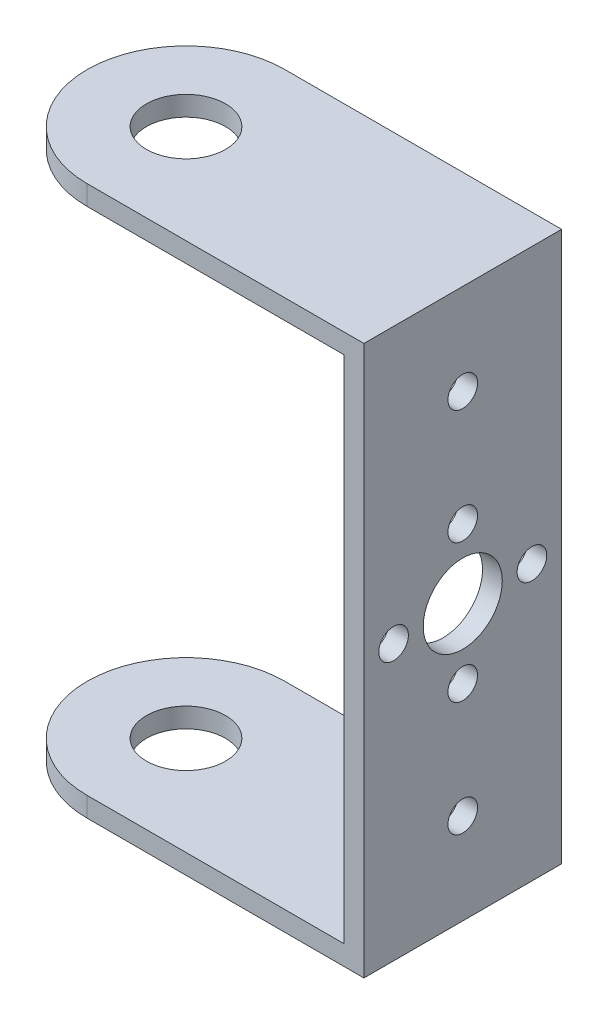
ISO-10303-21;
HEADER;
FILE_DESCRIPTION(('STEP AP214'),'2;1');
FILE_NAME('part.step','',(''),(''),'','','');
FILE_SCHEMA(('AUTOMOTIVE_DESIGN { 1 0 10303 214 1 1 1 1 }'));
ENDSEC;
DATA;
#1=APPLICATION_CONTEXT('core data for automotive mechanical design processes');
#2=APPLICATION_PROTOCOL_DEFINITION('international standard','automotive_design',2000,#1);
#3=PRODUCT_CONTEXT('',#1,'mechanical');
#4=PRODUCT('Part','Part','',(#3));
#5=PRODUCT_RELATED_PRODUCT_CATEGORY('part','',(#4));
#6=PRODUCT_DEFINITION_FORMATION('','',#4);
#7=PRODUCT_DEFINITION_CONTEXT('part definition',#1,'design');
#8=PRODUCT_DEFINITION('design','',#6,#7);
#9=PRODUCT_DEFINITION_SHAPE('','',#8);
#10=(LENGTH_UNIT() NAMED_UNIT(*) SI_UNIT(.MILLI.,.METRE.));
#11=(NAMED_UNIT(*) PLANE_ANGLE_UNIT() SI_UNIT($,.RADIAN.));
#12=(NAMED_UNIT(*) SI_UNIT($,.STERADIAN.) SOLID_ANGLE_UNIT());
#13=UNCERTAINTY_MEASURE_WITH_UNIT(LENGTH_MEASURE(1.E-05),#10,'distance_accuracy_value','');
#14=(GEOMETRIC_REPRESENTATION_CONTEXT(3) GLOBAL_UNCERTAINTY_ASSIGNED_CONTEXT((#13)) GLOBAL_UNIT_ASSIGNED_CONTEXT((#10,
#11,#12)) REPRESENTATION_CONTEXT('',''));
#15=CARTESIAN_POINT('',(0.,0.,0.));
#16=DIRECTION('',(0.,0.,1.));
#17=DIRECTION('',(1.,0.,0.));
#18=AXIS2_PLACEMENT_3D('',#15,#16,#17);
#19=CARTESIAN_POINT('',(14.0000000000001,-27.8000000000001,20.0000000000002));
#20=DIRECTION('',(-0.999999999999999,0.,0.));
#21=DIRECTION('',(0.,0.,0.999999999999999));
#22=AXIS2_PLACEMENT_3D('',#19,#20,#21);
#23=PLANE('',#22);
#24=CARTESIAN_POINT('',(14.,18.6000000000001,9.99999999999979));
#25=DIRECTION('',(0.999999999999999,0.,0.));
#26=DIRECTION('',(0.,0.,-0.999999999999999));
#27=AXIS2_PLACEMENT_3D('',#24,#25,#26);
#28=CIRCLE('',#27,1.5);
#29=CARTESIAN_POINT('',(14.,18.6000000000001,8.49999999999979));
#30=VERTEX_POINT('',#29);
#31=EDGE_CURVE('E209',#30,#30,#28,.T.);
#32=ORIENTED_EDGE('',*,*,#31,.F.);
#33=EDGE_LOOP('',(#32));
#34=FACE_BOUND('',#33,.T.);
#35=CARTESIAN_POINT('',(14.,-18.6000000000001,9.99999999999984));
#36=DIRECTION('',(0.999999999999999,0.,0.));
#37=DIRECTION('',(0.,0.,-0.999999999999999));
#38=AXIS2_PLACEMENT_3D('',#35,#36,#37);
#39=CIRCLE('',#38,1.5);
#40=CARTESIAN_POINT('',(14.,-18.6000000000001,8.49999999999984));
#41=VERTEX_POINT('',#40);
#42=EDGE_CURVE('E213',#41,#41,#39,.T.);
#43=ORIENTED_EDGE('',*,*,#42,.F.);
#44=EDGE_LOOP('',(#43));
#45=FACE_BOUND('',#44,.T.);
#46=CARTESIAN_POINT('',(14.,7.00000000000003,10.0000000000002));
#47=DIRECTION('',(0.999999999999999,0.,0.));
#48=DIRECTION('',(0.,0.,-0.999999999999999));
#49=AXIS2_PLACEMENT_3D('',#46,#47,#48);
#50=CIRCLE('',#49,1.5);
#51=CARTESIAN_POINT('',(14.,7.00000000000003,8.50000000000023));
#52=VERTEX_POINT('',#51);
#53=EDGE_CURVE('E217',#52,#52,#50,.T.);
#54=ORIENTED_EDGE('',*,*,#53,.F.);
#55=EDGE_LOOP('',(#54));
#56=FACE_BOUND('',#55,.T.);
#57=CARTESIAN_POINT('',(14.0000000000001,3.2612801348364E-12,3.00000000000267));
#58=DIRECTION('',(0.999999999999999,0.,0.));
#59=DIRECTION('',(0.,0.,-0.999999999999999));
#60=AXIS2_PLACEMENT_3D('',#57,#58,#59);
#61=CIRCLE('',#60,1.5);
#62=CARTESIAN_POINT('',(14.0000000000001,3.26161320174378E-12,1.50000000000267));
#63=VERTEX_POINT('',#62);
#64=EDGE_CURVE('E221',#63,#63,#61,.T.);
#65=ORIENTED_EDGE('',*,*,#64,.F.);
#66=EDGE_LOOP('',(#65));
#67=FACE_BOUND('',#66,.T.);
#68=CARTESIAN_POINT('',(14.0000000000001,-6.99999999999384,9.99999999999968));
#69=DIRECTION('',(0.999999999999999,0.,0.));
#70=DIRECTION('',(0.,0.,-0.999999999999999));
#71=AXIS2_PLACEMENT_3D('',#68,#69,#70);
#72=CIRCLE('',#71,1.5);
#73=CARTESIAN_POINT('',(14.0000000000001,-6.99999999999384,8.49999999999968));
#74=VERTEX_POINT('',#73);
#75=EDGE_CURVE('E225',#74,#74,#72,.T.);
#76=ORIENTED_EDGE('',*,*,#75,.F.);
#77=EDGE_LOOP('',(#76));
#78=FACE_BOUND('',#77,.T.);
#79=CARTESIAN_POINT('',(14.,2.94209101525666E-12,16.9999999999965));
#80=DIRECTION('',(0.999999999999999,0.,0.));
#81=DIRECTION('',(0.,0.,-0.999999999999999));
#82=AXIS2_PLACEMENT_3D('',#79,#80,#81);
#83=CIRCLE('',#82,1.5);
#84=CARTESIAN_POINT('',(14.,2.94242408216405E-12,15.4999999999965));
#85=VERTEX_POINT('',#84);
#86=EDGE_CURVE('E229',#85,#85,#83,.T.);
#87=ORIENTED_EDGE('',*,*,#86,.F.);
#88=EDGE_LOOP('',(#87));
#89=FACE_BOUND('',#88,.T.);
#90=CARTESIAN_POINT('',(13.9999999999998,0.,9.99999999999968));
#91=DIRECTION('',(0.999999999999999,0.,0.));
#92=DIRECTION('',(0.,0.,-0.999999999999999));
#93=AXIS2_PLACEMENT_3D('',#90,#91,#92);
#94=CIRCLE('',#93,4.);
#95=CARTESIAN_POINT('',(13.9999999999998,0.,5.99999999999968));
#96=VERTEX_POINT('',#95);
#97=EDGE_CURVE('E232',#96,#96,#94,.T.);
#98=ORIENTED_EDGE('',*,*,#97,.F.);
#99=EDGE_LOOP('',(#98));
#100=FACE_BOUND('',#99,.T.);
#101=DIRECTION('',(0.,1.00000000000001,0.));
#102=VECTOR('',#101,1.);
#103=CARTESIAN_POINT('',(13.9999999999999,-27.8,1.11022302462516E-13));
#104=LINE('',#103,#102);
#105=CARTESIAN_POINT('',(13.9999999999999,-27.8,1.11022302462516E-13));
#106=VERTEX_POINT('',#105);
#107=CARTESIAN_POINT('',(14.0000000000001,27.8000000000002,-3.88578058618805E-13));
#108=VERTEX_POINT('',#107);
#109=EDGE_CURVE('E138',#106,#108,#104,.T.);
#110=ORIENTED_EDGE('',*,*,#109,.T.);
#111=DIRECTION('',(0.,0.,-0.999999999999999));
#112=VECTOR('',#111,1.);
#113=CARTESIAN_POINT('',(14.,27.8000000000002,19.9999999999996));
#114=LINE('',#113,#112);
#115=CARTESIAN_POINT('',(14.,27.8000000000002,19.9999999999996));
#116=VERTEX_POINT('',#115);
#117=EDGE_CURVE('E11',#116,#108,#114,.T.);
#118=ORIENTED_EDGE('',*,*,#117,.F.);
#119=DIRECTION('',(0.,1.00000000000001,0.));
#120=VECTOR('',#119,1.);
#121=CARTESIAN_POINT('',(14.0000000000001,-27.8000000000001,20.0000000000002));
#122=LINE('',#121,#120);
#123=CARTESIAN_POINT('',(14.0000000000001,-27.8000000000001,20.0000000000002));
#124=VERTEX_POINT('',#123);
#125=EDGE_CURVE('E140',#124,#116,#122,.T.);
#126=ORIENTED_EDGE('',*,*,#125,.F.);
#127=DIRECTION('',(0.,0.,-0.999999999999999));
#128=VECTOR('',#127,1.);
#129=CARTESIAN_POINT('',(14.0000000000001,-27.8000000000001,20.0000000000002));
#130=LINE('',#129,#128);
#131=EDGE_CURVE('E149',#124,#106,#130,.T.);
#132=ORIENTED_EDGE('',*,*,#131,.T.);
#133=EDGE_LOOP('',(#110,#118,#126,#132));
#134=FACE_BOUND('',#133,.T.);
#135=ADVANCED_FACE('F40',(#34,#45,#56,#67,#78,#89,#100,#134),#23,.F.);
#136=CARTESIAN_POINT('',(-13.9999999999998,27.8000000000002,19.9999999999999));
#137=DIRECTION('',(0.,-1.00000000000001,0.));
#138=DIRECTION('',(0.,0.,-0.999999999999999));
#139=AXIS2_PLACEMENT_3D('',#136,#137,#138);
#140=PLANE('',#139);
#141=CARTESIAN_POINT('',(-14.,27.8000000000002,9.99999999999984));
#142=DIRECTION('',(0.,1.00000000000001,0.));
#143=DIRECTION('',(0.,0.,0.999999999999999));
#144=AXIS2_PLACEMENT_3D('',#141,#142,#143);
#145=CIRCLE('',#144,4.);
#146=CARTESIAN_POINT('',(-14.,27.8000000000002,13.9999999999998));
#147=VERTEX_POINT('',#146);
#148=EDGE_CURVE('E131',#147,#147,#145,.T.);
#149=ORIENTED_EDGE('',*,*,#148,.F.);
#150=EDGE_LOOP('',(#149));
#151=FACE_BOUND('',#150,.T.);
#152=DIRECTION('',(-1.,0.,0.));
#153=VECTOR('',#152,1.);
#154=CARTESIAN_POINT('',(-14.,27.8,0.));
#155=LINE('',#154,#153);
#156=CARTESIAN_POINT('',(-14.,27.8,0.));
#157=VERTEX_POINT('',#156);
#158=EDGE_CURVE('E152',#108,#157,#155,.T.);
#159=ORIENTED_EDGE('',*,*,#158,.T.);
#160=CARTESIAN_POINT('',(-14.,27.8000000000002,9.99999999999984));
#161=DIRECTION('',(0.,1.00000000000001,0.));
#162=DIRECTION('',(0.,0.,0.999999999999999));
#163=AXIS2_PLACEMENT_3D('',#160,#161,#162);
#164=CIRCLE('',#163,10.);
#165=CARTESIAN_POINT('',(-13.9999999999998,27.8000000000002,19.9999999999999));
#166=VERTEX_POINT('',#165);
#167=EDGE_CURVE('E128',#157,#166,#164,.T.);
#168=ORIENTED_EDGE('',*,*,#167,.T.);
#169=DIRECTION('',(-1.,0.,0.));
#170=VECTOR('',#169,1.);
#171=CARTESIAN_POINT('',(-13.9999999999998,27.8000000000002,19.9999999999999));
#172=LINE('',#171,#170);
#173=EDGE_CURVE('E94',#116,#166,#172,.T.);
#174=ORIENTED_EDGE('',*,*,#173,.F.);
#175=ORIENTED_EDGE('',*,*,#117,.T.);
#176=EDGE_LOOP('',(#159,#168,#174,#175));
#177=FACE_BOUND('',#176,.T.);
#178=ADVANCED_FACE('F190',(#151,#177),#140,.F.);
#179=CARTESIAN_POINT('',(-12.0000000000001,25.8,20.0000000000002));
#180=DIRECTION('',(0.,1.00000000000001,0.));
#181=DIRECTION('',(0.,0.,0.999999999999999));
#182=AXIS2_PLACEMENT_3D('',#179,#180,#181);
#183=PLANE('',#182);
#184=CARTESIAN_POINT('',(-13.9999999999998,25.8000000000002,9.99999999999995));
#185=DIRECTION('',(0.,1.00000000000001,0.));
#186=DIRECTION('',(0.,0.,0.999999999999999));
#187=AXIS2_PLACEMENT_3D('',#184,#185,#186);
#188=CIRCLE('',#187,4.);
#189=CARTESIAN_POINT('',(-13.9999999999999,25.8000000000002,14.));
#190=VERTEX_POINT('',#189);
#191=EDGE_CURVE('E126',#190,#190,#188,.T.);
#192=ORIENTED_EDGE('',*,*,#191,.T.);
#193=EDGE_LOOP('',(#192));
#194=FACE_BOUND('',#193,.T.);
#195=DIRECTION('',(0.999999999999999,0.,0.));
#196=VECTOR('',#195,1.);
#197=CARTESIAN_POINT('',(-11.9999999999998,25.8000000000001,1.11022302462516E-13));
#198=LINE('',#197,#196);
#199=CARTESIAN_POINT('',(-14.,25.8000000000001,2.77555756156289E-13));
#200=VERTEX_POINT('',#199);
#201=CARTESIAN_POINT('',(12.,25.8,0.));
#202=VERTEX_POINT('',#201);
#203=EDGE_CURVE('E157',#200,#202,#198,.T.);
#204=ORIENTED_EDGE('',*,*,#203,.T.);
#205=DIRECTION('',(0.,0.,-0.999999999999999));
#206=VECTOR('',#205,1.);
#207=CARTESIAN_POINT('',(12.,25.8000000000001,19.9999999999998));
#208=LINE('',#207,#206);
#209=CARTESIAN_POINT('',(12.,25.8000000000001,19.9999999999998));
#210=VERTEX_POINT('',#209);
#211=EDGE_CURVE('E48',#210,#202,#208,.T.);
#212=ORIENTED_EDGE('',*,*,#211,.F.);
#213=DIRECTION('',(0.999999999999999,0.,0.));
#214=VECTOR('',#213,1.);
#215=CARTESIAN_POINT('',(-12.0000000000001,25.8,20.0000000000002));
#216=LINE('',#215,#214);
#217=CARTESIAN_POINT('',(-13.9999999999999,25.8,20.0000000000002));
#218=VERTEX_POINT('',#217);
#219=EDGE_CURVE('E145',#218,#210,#216,.T.);
#220=ORIENTED_EDGE('',*,*,#219,.F.);
#221=CARTESIAN_POINT('',(-13.9999999999998,25.8000000000002,9.99999999999995));
#222=DIRECTION('',(0.,1.00000000000001,0.));
#223=DIRECTION('',(0.,0.,0.999999999999999));
#224=AXIS2_PLACEMENT_3D('',#221,#222,#223);
#225=CIRCLE('',#224,10.);
#226=EDGE_CURVE('E135',#200,#218,#225,.T.);
#227=ORIENTED_EDGE('',*,*,#226,.F.);
#228=EDGE_LOOP('',(#204,#212,#220,#227));
#229=FACE_BOUND('',#228,.T.);
#230=ADVANCED_FACE('F191',(#194,#229),#183,.F.);
#231=CARTESIAN_POINT('',(12.,-25.8000000000002,19.9999999999999));
#232=DIRECTION('',(0.999999999999999,0.,0.));
#233=DIRECTION('',(0.,1.00000000000001,0.));
#234=AXIS2_PLACEMENT_3D('',#231,#232,#233);
#235=PLANE('',#234);
#236=CARTESIAN_POINT('',(12.,18.6000000000001,9.99999999999973));
#237=DIRECTION('',(0.999999999999999,0.,0.));
#238=DIRECTION('',(0.,0.,-0.999999999999999));
#239=AXIS2_PLACEMENT_3D('',#236,#237,#238);
#240=CIRCLE('',#239,1.5);
#241=CARTESIAN_POINT('',(12.,18.6000000000001,8.49999999999973));
#242=VERTEX_POINT('',#241);
#243=EDGE_CURVE('E389',#242,#242,#240,.T.);
#244=ORIENTED_EDGE('',*,*,#243,.T.);
#245=EDGE_LOOP('',(#244));
#246=FACE_BOUND('',#245,.T.);
#247=CARTESIAN_POINT('',(12.0000000000002,-18.6000000000001,9.99999999999995));
#248=DIRECTION('',(0.999999999999999,0.,0.));
#249=DIRECTION('',(0.,0.,-0.999999999999999));
#250=AXIS2_PLACEMENT_3D('',#247,#248,#249);
#251=CIRCLE('',#250,1.5);
#252=CARTESIAN_POINT('',(12.0000000000002,-18.6000000000001,8.49999999999995));
#253=VERTEX_POINT('',#252);
#254=EDGE_CURVE('E390',#253,#253,#251,.T.);
#255=ORIENTED_EDGE('',*,*,#254,.T.);
#256=EDGE_LOOP('',(#255));
#257=FACE_BOUND('',#256,.T.);
#258=CARTESIAN_POINT('',(12.,7.00000000000005,10.0000000000001));
#259=DIRECTION('',(0.999999999999999,0.,0.));
#260=DIRECTION('',(0.,0.,-0.999999999999999));
#261=AXIS2_PLACEMENT_3D('',#258,#259,#260);
#262=CIRCLE('',#261,1.5);
#263=CARTESIAN_POINT('',(12.,7.00000000000005,8.50000000000006));
#264=VERTEX_POINT('',#263);
#265=EDGE_CURVE('E235',#264,#264,#262,.T.);
#266=ORIENTED_EDGE('',*,*,#265,.T.);
#267=EDGE_LOOP('',(#266));
#268=FACE_BOUND('',#267,.T.);
#269=CARTESIAN_POINT('',(12.0000000000001,3.28903571045203E-12,3.00000000000245));
#270=DIRECTION('',(0.999999999999999,0.,0.));
#271=DIRECTION('',(0.,0.,-0.999999999999999));
#272=AXIS2_PLACEMENT_3D('',#269,#270,#271);
#273=CIRCLE('',#272,1.5);
#274=CARTESIAN_POINT('',(12.0000000000001,3.28936877735941E-12,1.50000000000245));
#275=VERTEX_POINT('',#274);
#276=EDGE_CURVE('E398',#275,#275,#273,.T.);
#277=ORIENTED_EDGE('',*,*,#276,.T.);
#278=EDGE_LOOP('',(#277));
#279=FACE_BOUND('',#278,.T.);
#280=CARTESIAN_POINT('',(12.0000000000001,-6.99999999999396,9.99999999999956));
#281=DIRECTION('',(0.999999999999999,0.,0.));
#282=DIRECTION('',(0.,0.,-0.999999999999999));
#283=AXIS2_PLACEMENT_3D('',#280,#281,#282);
#284=CIRCLE('',#283,1.5);
#285=CARTESIAN_POINT('',(12.0000000000001,-6.99999999999396,8.49999999999956));
#286=VERTEX_POINT('',#285);
#287=EDGE_CURVE('E402',#286,#286,#284,.T.);
#288=ORIENTED_EDGE('',*,*,#287,.T.);
#289=EDGE_LOOP('',(#288));
#290=FACE_BOUND('',#289,.T.);
#291=CARTESIAN_POINT('',(12.0000000000001,2.91433543964104E-12,16.9999999999964));
#292=DIRECTION('',(0.999999999999999,0.,0.));
#293=DIRECTION('',(0.,0.,-0.999999999999999));
#294=AXIS2_PLACEMENT_3D('',#291,#292,#293);
#295=CIRCLE('',#294,1.5);
#296=CARTESIAN_POINT('',(12.0000000000001,2.91466850654842E-12,15.4999999999963));
#297=VERTEX_POINT('',#296);
#298=EDGE_CURVE('E406',#297,#297,#295,.T.);
#299=ORIENTED_EDGE('',*,*,#298,.T.);
#300=EDGE_LOOP('',(#299));
#301=FACE_BOUND('',#300,.T.);
#302=CARTESIAN_POINT('',(11.9999999999999,0.,9.99999999999962));
#303=DIRECTION('',(0.999999999999999,0.,0.));
#304=DIRECTION('',(0.,0.,-0.999999999999999));
#305=AXIS2_PLACEMENT_3D('',#302,#303,#304);
#306=CIRCLE('',#305,4.);
#307=CARTESIAN_POINT('',(11.9999999999999,0.,5.99999999999962));
#308=VERTEX_POINT('',#307);
#309=EDGE_CURVE('E234',#308,#308,#306,.T.);
#310=ORIENTED_EDGE('',*,*,#309,.T.);
#311=EDGE_LOOP('',(#310));
#312=FACE_BOUND('',#311,.T.);
#313=DIRECTION('',(0.,-1.00000000000001,0.));
#314=VECTOR('',#313,1.);
#315=CARTESIAN_POINT('',(12.0000000000002,-25.8,0.));
#316=LINE('',#315,#314);
#317=CARTESIAN_POINT('',(12.0000000000002,-25.8,0.));
#318=VERTEX_POINT('',#317);
#319=EDGE_CURVE('E159',#202,#318,#316,.T.);
#320=ORIENTED_EDGE('',*,*,#319,.T.);
#321=DIRECTION('',(0.,0.,-0.999999999999999));
#322=VECTOR('',#321,1.);
#323=CARTESIAN_POINT('',(12.,-25.8000000000002,19.9999999999999));
#324=LINE('',#323,#322);
#325=CARTESIAN_POINT('',(12.,-25.8000000000002,19.9999999999999));
#326=VERTEX_POINT('',#325);
#327=EDGE_CURVE('E167',#326,#318,#324,.T.);
#328=ORIENTED_EDGE('',*,*,#327,.F.);
#329=DIRECTION('',(0.,-1.00000000000001,0.));
#330=VECTOR('',#329,1.);
#331=CARTESIAN_POINT('',(12.,-25.8000000000002,19.9999999999999));
#332=LINE('',#331,#330);
#333=EDGE_CURVE('E114',#210,#326,#332,.T.);
#334=ORIENTED_EDGE('',*,*,#333,.F.);
#335=ORIENTED_EDGE('',*,*,#211,.T.);
#336=EDGE_LOOP('',(#320,#328,#334,#335));
#337=FACE_BOUND('',#336,.T.);
#338=ADVANCED_FACE('F172',(#246,#257,#268,#279,#290,#301,#312,#337),#235,.F.);
#339=CARTESIAN_POINT('',(-14.,-25.8000000000002,20.0000000000001));
#340=DIRECTION('',(0.,-1.00000000000001,0.));
#341=DIRECTION('',(0.,0.,-0.999999999999999));
#342=AXIS2_PLACEMENT_3D('',#339,#340,#341);
#343=PLANE('',#342);
#344=CARTESIAN_POINT('',(-13.9999999999999,-25.8000000000003,10.0000000000001));
#345=DIRECTION('',(0.,1.00000000000001,0.));
#346=DIRECTION('',(0.,0.,0.999999999999999));
#347=AXIS2_PLACEMENT_3D('',#344,#345,#346);
#348=CIRCLE('',#347,4.);
#349=CARTESIAN_POINT('',(-13.9999999999999,-25.8000000000003,14.0000000000001));
#350=VERTEX_POINT('',#349);
#351=EDGE_CURVE('E238',#350,#350,#348,.T.);
#352=ORIENTED_EDGE('',*,*,#351,.F.);
#353=EDGE_LOOP('',(#352));
#354=FACE_BOUND('',#353,.T.);
#355=DIRECTION('',(-0.999999999999999,0.,0.));
#356=VECTOR('',#355,1.);
#357=CARTESIAN_POINT('',(-13.9999999999999,-25.8000000000002,1.11022302462516E-13));
#358=LINE('',#357,#356);
#359=CARTESIAN_POINT('',(-13.9999999999999,-25.8000000000002,1.11022302462516E-13));
#360=VERTEX_POINT('',#359);
#361=EDGE_CURVE('E79',#318,#360,#358,.T.);
#362=ORIENTED_EDGE('',*,*,#361,.T.);
#363=CARTESIAN_POINT('',(-13.9999999999999,-25.8000000000003,10.0000000000001));
#364=DIRECTION('',(0.,1.00000000000001,0.));
#365=DIRECTION('',(0.,0.,0.999999999999999));
#366=AXIS2_PLACEMENT_3D('',#363,#364,#365);
#367=CIRCLE('',#366,10.);
#368=CARTESIAN_POINT('',(-14.,-25.8000000000002,20.0000000000001));
#369=VERTEX_POINT('',#368);
#370=EDGE_CURVE('E122',#360,#369,#367,.T.);
#371=ORIENTED_EDGE('',*,*,#370,.T.);
#372=DIRECTION('',(-0.999999999999999,0.,0.));
#373=VECTOR('',#372,1.);
#374=CARTESIAN_POINT('',(-12.,-25.8000000000002,20.));
#375=LINE('',#374,#373);
#376=EDGE_CURVE('E109',#326,#369,#375,.T.);
#377=ORIENTED_EDGE('',*,*,#376,.F.);
#378=ORIENTED_EDGE('',*,*,#327,.T.);
#379=EDGE_LOOP('',(#362,#371,#377,#378));
#380=FACE_BOUND('',#379,.T.);
#381=ADVANCED_FACE('F125',(#354,#380),#343,.F.);
#382=CARTESIAN_POINT('',(-14.0000000000001,-27.8000000000001,20.0000000000004));
#383=DIRECTION('',(0.,1.00000000000001,0.));
#384=DIRECTION('',(0.,0.,0.999999999999999));
#385=AXIS2_PLACEMENT_3D('',#382,#383,#384);
#386=PLANE('',#385);
#387=CARTESIAN_POINT('',(-13.9999999999998,-27.8000000000001,10.0000000000002));
#388=DIRECTION('',(0.,1.00000000000001,0.));
#389=DIRECTION('',(0.,0.,0.999999999999999));
#390=AXIS2_PLACEMENT_3D('',#387,#388,#389);
#391=CIRCLE('',#390,4.);
#392=CARTESIAN_POINT('',(-13.9999999999999,-27.8000000000001,14.0000000000002));
#393=VERTEX_POINT('',#392);
#394=EDGE_CURVE('E244',#393,#393,#391,.T.);
#395=ORIENTED_EDGE('',*,*,#394,.T.);
#396=EDGE_LOOP('',(#395));
#397=FACE_BOUND('',#396,.T.);
#398=DIRECTION('',(1.,0.,0.));
#399=VECTOR('',#398,1.);
#400=CARTESIAN_POINT('',(-14.0000000000001,-27.8000000000002,1.66533453693773E-13));
#401=LINE('',#400,#399);
#402=CARTESIAN_POINT('',(-14.0000000000001,-27.8000000000002,1.66533453693773E-13));
#403=VERTEX_POINT('',#402);
#404=EDGE_CURVE('E86',#403,#106,#401,.T.);
#405=ORIENTED_EDGE('',*,*,#404,.T.);
#406=ORIENTED_EDGE('',*,*,#131,.F.);
#407=DIRECTION('',(1.,0.,0.));
#408=VECTOR('',#407,1.);
#409=CARTESIAN_POINT('',(-14.0000000000001,-27.8000000000001,20.0000000000004));
#410=LINE('',#409,#408);
#411=CARTESIAN_POINT('',(-14.0000000000001,-27.8000000000001,20.0000000000004));
#412=VERTEX_POINT('',#411);
#413=EDGE_CURVE('E56',#412,#124,#410,.T.);
#414=ORIENTED_EDGE('',*,*,#413,.F.);
#415=CARTESIAN_POINT('',(-13.9999999999998,-27.8000000000001,10.0000000000002));
#416=DIRECTION('',(0.,1.00000000000001,0.));
#417=DIRECTION('',(0.,0.,0.999999999999999));
#418=AXIS2_PLACEMENT_3D('',#415,#416,#417);
#419=CIRCLE('',#418,10.);
#420=EDGE_CURVE('E123',#403,#412,#419,.T.);
#421=ORIENTED_EDGE('',*,*,#420,.F.);
#422=EDGE_LOOP('',(#405,#406,#414,#421));
#423=FACE_BOUND('',#422,.T.);
#424=ADVANCED_FACE('F181',(#397,#423),#386,.F.);
#425=CARTESIAN_POINT('',(0.,0.,20.));
#426=DIRECTION('',(0.,0.,-0.999999999999999));
#427=DIRECTION('',(-0.999999999999999,0.,0.));
#428=AXIS2_PLACEMENT_3D('',#425,#426,#427);
#429=PLANE('',#428);
#430=ORIENTED_EDGE('',*,*,#125,.T.);
#431=ORIENTED_EDGE('',*,*,#173,.T.);
#432=DIRECTION('',(0.,-1.00000000000001,0.));
#433=VECTOR('',#432,1.);
#434=CARTESIAN_POINT('',(-13.9999999999999,25.8,20.0000000000002));
#435=LINE('',#434,#433);
#436=EDGE_CURVE('E143',#166,#218,#435,.T.);
#437=ORIENTED_EDGE('',*,*,#436,.T.);
#438=ORIENTED_EDGE('',*,*,#219,.T.);
#439=ORIENTED_EDGE('',*,*,#333,.T.);
#440=ORIENTED_EDGE('',*,*,#376,.T.);
#441=DIRECTION('',(0.,-1.00000000000001,0.));
#442=VECTOR('',#441,1.);
#443=CARTESIAN_POINT('',(-14.0000000000001,-27.8000000000001,20.0000000000004));
#444=LINE('',#443,#442);
#445=EDGE_CURVE('E112',#369,#412,#444,.T.);
#446=ORIENTED_EDGE('',*,*,#445,.T.);
#447=ORIENTED_EDGE('',*,*,#413,.T.);
#448=EDGE_LOOP('',(#430,#431,#437,#438,#439,#440,#446,#447));
#449=FACE_BOUND('',#448,.T.);
#450=ADVANCED_FACE('F111',(#449),#429,.F.);
#451=CARTESIAN_POINT('',(0.,0.,0.));
#452=DIRECTION('',(0.,0.,-0.999999999999999));
#453=DIRECTION('',(-0.999999999999999,0.,0.));
#454=AXIS2_PLACEMENT_3D('',#451,#452,#453);
#455=PLANE('',#454);
#456=ORIENTED_EDGE('',*,*,#109,.F.);
#457=ORIENTED_EDGE('',*,*,#404,.F.);
#458=DIRECTION('',(0.,-1.00000000000001,0.));
#459=VECTOR('',#458,1.);
#460=CARTESIAN_POINT('',(-14.0000000000001,-27.8000000000002,1.66533453693773E-13));
#461=LINE('',#460,#459);
#462=EDGE_CURVE('E163',#360,#403,#461,.T.);
#463=ORIENTED_EDGE('',*,*,#462,.F.);
#464=ORIENTED_EDGE('',*,*,#361,.F.);
#465=ORIENTED_EDGE('',*,*,#319,.F.);
#466=ORIENTED_EDGE('',*,*,#203,.F.);
#467=DIRECTION('',(0.,-1.00000000000001,0.));
#468=VECTOR('',#467,1.);
#469=CARTESIAN_POINT('',(-14.,25.8000000000001,2.77555756156289E-13));
#470=LINE('',#469,#468);
#471=EDGE_CURVE('E154',#157,#200,#470,.T.);
#472=ORIENTED_EDGE('',*,*,#471,.F.);
#473=ORIENTED_EDGE('',*,*,#158,.F.);
#474=EDGE_LOOP('',(#456,#457,#463,#464,#465,#466,#472,#473));
#475=FACE_BOUND('',#474,.T.);
#476=ADVANCED_FACE('F178',(#475),#455,.T.);
#477=CARTESIAN_POINT('',(-13.9999999999998,25.8000000000002,9.99999999999995));
#478=DIRECTION('',(0.,1.00000000000001,0.));
#479=DIRECTION('',(0.,0.,0.999999999999999));
#480=AXIS2_PLACEMENT_3D('',#477,#478,#479);
#481=CYLINDRICAL_SURFACE('',#480,10.);
#482=ORIENTED_EDGE('',*,*,#167,.F.);
#483=ORIENTED_EDGE('',*,*,#471,.T.);
#484=ORIENTED_EDGE('',*,*,#226,.T.);
#485=ORIENTED_EDGE('',*,*,#436,.F.);
#486=EDGE_LOOP('',(#482,#483,#484,#485));
#487=FACE_BOUND('',#486,.T.);
#488=ADVANCED_FACE('F188',(#487),#481,.T.);
#489=CARTESIAN_POINT('',(-13.9999999999998,-27.8000000000001,10.0000000000002));
#490=DIRECTION('',(0.,1.00000000000001,0.));
#491=DIRECTION('',(0.,0.,0.999999999999999));
#492=AXIS2_PLACEMENT_3D('',#489,#490,#491);
#493=CYLINDRICAL_SURFACE('',#492,10.);
#494=ORIENTED_EDGE('',*,*,#370,.F.);
#495=ORIENTED_EDGE('',*,*,#462,.T.);
#496=ORIENTED_EDGE('',*,*,#420,.T.);
#497=ORIENTED_EDGE('',*,*,#445,.F.);
#498=EDGE_LOOP('',(#494,#495,#496,#497));
#499=FACE_BOUND('',#498,.T.);
#500=ADVANCED_FACE('F120',(#499),#493,.T.);
#501=CARTESIAN_POINT('',(-13.9999999999998,25.8000000000002,9.99999999999995));
#502=DIRECTION('',(0.,1.00000000000001,0.));
#503=DIRECTION('',(0.,0.,0.999999999999999));
#504=AXIS2_PLACEMENT_3D('',#501,#502,#503);
#505=CYLINDRICAL_SURFACE('',#504,4.);
#506=ORIENTED_EDGE('',*,*,#191,.F.);
#507=EDGE_LOOP('',(#506));
#508=FACE_BOUND('',#507,.T.);
#509=ORIENTED_EDGE('',*,*,#148,.T.);
#510=EDGE_LOOP('',(#509));
#511=FACE_BOUND('',#510,.T.);
#512=ADVANCED_FACE('F251',(#508,#511),#505,.F.);
#513=CARTESIAN_POINT('',(-13.9999999999998,-27.8000000000001,10.0000000000002));
#514=DIRECTION('',(0.,1.00000000000001,0.));
#515=DIRECTION('',(0.,0.,0.999999999999999));
#516=AXIS2_PLACEMENT_3D('',#513,#514,#515);
#517=CYLINDRICAL_SURFACE('',#516,4.);
#518=ORIENTED_EDGE('',*,*,#394,.F.);
#519=EDGE_LOOP('',(#518));
#520=FACE_BOUND('',#519,.T.);
#521=ORIENTED_EDGE('',*,*,#351,.T.);
#522=EDGE_LOOP('',(#521));
#523=FACE_BOUND('',#522,.T.);
#524=ADVANCED_FACE('F253',(#520,#523),#517,.F.);
#525=CARTESIAN_POINT('',(11.9999999999999,0.,9.99999999999962));
#526=DIRECTION('',(0.999999999999999,0.,0.));
#527=DIRECTION('',(0.,0.,-0.999999999999999));
#528=AXIS2_PLACEMENT_3D('',#525,#526,#527);
#529=CYLINDRICAL_SURFACE('',#528,4.);
#530=ORIENTED_EDGE('',*,*,#309,.F.);
#531=EDGE_LOOP('',(#530));
#532=FACE_BOUND('',#531,.T.);
#533=ORIENTED_EDGE('',*,*,#97,.T.);
#534=EDGE_LOOP('',(#533));
#535=FACE_BOUND('',#534,.T.);
#536=ADVANCED_FACE('F260',(#532,#535),#529,.F.);
#537=CARTESIAN_POINT('',(12.0000000000001,2.91433543964104E-12,16.9999999999964));
#538=DIRECTION('',(0.999999999999999,0.,0.));
#539=DIRECTION('',(0.,0.,-0.999999999999999));
#540=AXIS2_PLACEMENT_3D('',#537,#538,#539);
#541=CYLINDRICAL_SURFACE('',#540,1.5);
#542=ORIENTED_EDGE('',*,*,#298,.F.);
#543=EDGE_LOOP('',(#542));
#544=FACE_BOUND('',#543,.T.);
#545=ORIENTED_EDGE('',*,*,#86,.T.);
#546=EDGE_LOOP('',(#545));
#547=FACE_BOUND('',#546,.T.);
#548=ADVANCED_FACE('F323',(#544,#547),#541,.F.);
#549=CARTESIAN_POINT('',(12.0000000000001,-6.99999999999396,9.99999999999956));
#550=DIRECTION('',(0.999999999999999,0.,0.));
#551=DIRECTION('',(0.,0.,-0.999999999999999));
#552=AXIS2_PLACEMENT_3D('',#549,#550,#551);
#553=CYLINDRICAL_SURFACE('',#552,1.5);
#554=ORIENTED_EDGE('',*,*,#287,.F.);
#555=EDGE_LOOP('',(#554));
#556=FACE_BOUND('',#555,.T.);
#557=ORIENTED_EDGE('',*,*,#75,.T.);
#558=EDGE_LOOP('',(#557));
#559=FACE_BOUND('',#558,.T.);
#560=ADVANCED_FACE('F332',(#556,#559),#553,.F.);
#561=CARTESIAN_POINT('',(12.0000000000001,3.28903571045203E-12,3.00000000000245));
#562=DIRECTION('',(0.999999999999999,0.,0.));
#563=DIRECTION('',(0.,0.,-0.999999999999999));
#564=AXIS2_PLACEMENT_3D('',#561,#562,#563);
#565=CYLINDRICAL_SURFACE('',#564,1.5);
#566=ORIENTED_EDGE('',*,*,#276,.F.);
#567=EDGE_LOOP('',(#566));
#568=FACE_BOUND('',#567,.T.);
#569=ORIENTED_EDGE('',*,*,#64,.T.);
#570=EDGE_LOOP('',(#569));
#571=FACE_BOUND('',#570,.T.);
#572=ADVANCED_FACE('F342',(#568,#571),#565,.F.);
#573=CARTESIAN_POINT('',(12.,7.00000000000005,10.0000000000001));
#574=DIRECTION('',(0.999999999999999,0.,0.));
#575=DIRECTION('',(0.,0.,-0.999999999999999));
#576=AXIS2_PLACEMENT_3D('',#573,#574,#575);
#577=CYLINDRICAL_SURFACE('',#576,1.5);
#578=ORIENTED_EDGE('',*,*,#265,.F.);
#579=EDGE_LOOP('',(#578));
#580=FACE_BOUND('',#579,.T.);
#581=ORIENTED_EDGE('',*,*,#53,.T.);
#582=EDGE_LOOP('',(#581));
#583=FACE_BOUND('',#582,.T.);
#584=ADVANCED_FACE('F352',(#580,#583),#577,.F.);
#585=CARTESIAN_POINT('',(12.0000000000002,-18.6000000000001,9.99999999999995));
#586=DIRECTION('',(0.999999999999999,0.,0.));
#587=DIRECTION('',(0.,0.,-0.999999999999999));
#588=AXIS2_PLACEMENT_3D('',#585,#586,#587);
#589=CYLINDRICAL_SURFACE('',#588,1.5);
#590=ORIENTED_EDGE('',*,*,#254,.F.);
#591=EDGE_LOOP('',(#590));
#592=FACE_BOUND('',#591,.T.);
#593=ORIENTED_EDGE('',*,*,#42,.T.);
#594=EDGE_LOOP('',(#593));
#595=FACE_BOUND('',#594,.T.);
#596=ADVANCED_FACE('F362',(#592,#595),#589,.F.);
#597=CARTESIAN_POINT('',(12.,18.6000000000001,9.99999999999973));
#598=DIRECTION('',(0.999999999999999,0.,0.));
#599=DIRECTION('',(0.,0.,-0.999999999999999));
#600=AXIS2_PLACEMENT_3D('',#597,#598,#599);
#601=CYLINDRICAL_SURFACE('',#600,1.5);
#602=ORIENTED_EDGE('',*,*,#243,.F.);
#603=EDGE_LOOP('',(#602));
#604=FACE_BOUND('',#603,.T.);
#605=ORIENTED_EDGE('',*,*,#31,.T.);
#606=EDGE_LOOP('',(#605));
#607=FACE_BOUND('',#606,.T.);
#608=ADVANCED_FACE('F372',(#604,#607),#601,.F.);
#609=CLOSED_SHELL('',(#135,#178,#230,#338,#381,#424,#450,#476,#488,#500,#512,#524,#536,#548,
#560,#572,#584,#596,#608));
#610=MANIFOLD_SOLID_BREP('B2',#609);
#611=ADVANCED_BREP_SHAPE_REPRESENTATION('',(#18,#610),#14);
#612=SHAPE_DEFINITION_REPRESENTATION(#9,#611);
ENDSEC;
END-ISO-10303-21;
